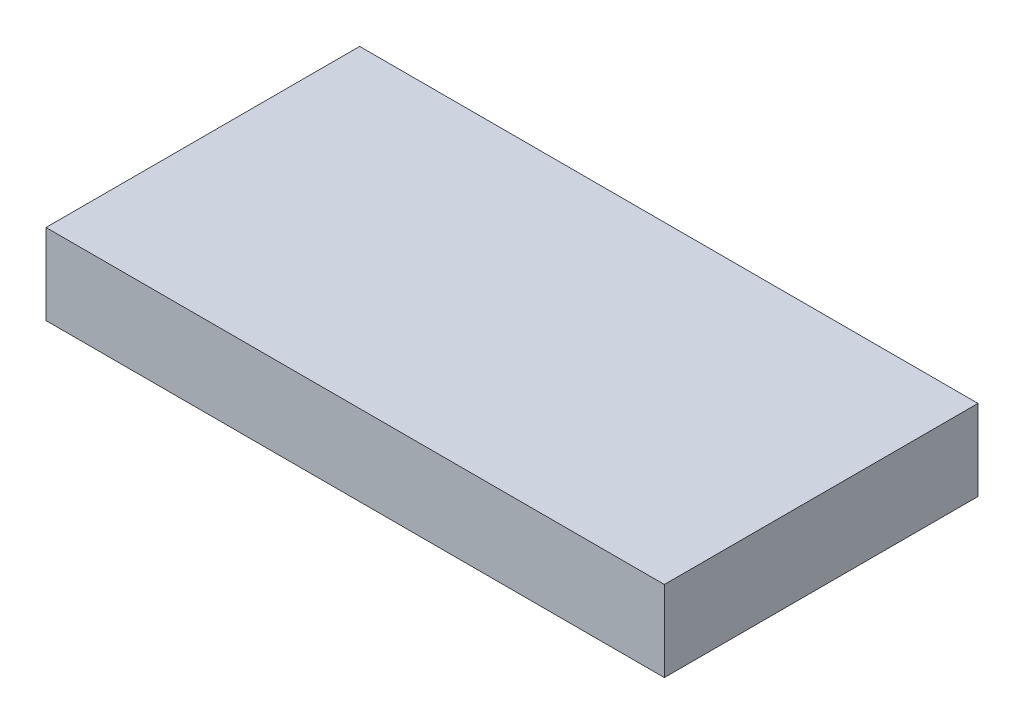
ISO-10303-21;
HEADER;
FILE_DESCRIPTION(('STEP AP214'),'2;1');
FILE_NAME('part.step','',(''),(''),'','','');
FILE_SCHEMA(('AUTOMOTIVE_DESIGN { 1 0 10303 214 1 1 1 1 }'));
ENDSEC;
DATA;
#1=APPLICATION_CONTEXT('core data for automotive mechanical design processes');
#2=APPLICATION_PROTOCOL_DEFINITION('international standard','automotive_design',2000,#1);
#3=PRODUCT_CONTEXT('',#1,'mechanical');
#4=PRODUCT('Part','Part','',(#3));
#5=PRODUCT_RELATED_PRODUCT_CATEGORY('part','',(#4));
#6=PRODUCT_DEFINITION_FORMATION('','',#4);
#7=PRODUCT_DEFINITION_CONTEXT('part definition',#1,'design');
#8=PRODUCT_DEFINITION('design','',#6,#7);
#9=PRODUCT_DEFINITION_SHAPE('','',#8);
#10=(LENGTH_UNIT() NAMED_UNIT(*) SI_UNIT(.MILLI.,.METRE.));
#11=(NAMED_UNIT(*) PLANE_ANGLE_UNIT() SI_UNIT($,.RADIAN.));
#12=(NAMED_UNIT(*) SI_UNIT($,.STERADIAN.) SOLID_ANGLE_UNIT());
#13=UNCERTAINTY_MEASURE_WITH_UNIT(LENGTH_MEASURE(1.E-05),#10,'distance_accuracy_value','');
#14=(GEOMETRIC_REPRESENTATION_CONTEXT(3) GLOBAL_UNCERTAINTY_ASSIGNED_CONTEXT((#13)) GLOBAL_UNIT_ASSIGNED_CONTEXT((#10,
#11,#12)) REPRESENTATION_CONTEXT('',''));
#15=CARTESIAN_POINT('',(0.,0.,0.));
#16=DIRECTION('',(0.,0.,1.));
#17=DIRECTION('',(1.,0.,0.));
#18=AXIS2_PLACEMENT_3D('',#15,#16,#17);
#19=CARTESIAN_POINT('',(-25.693945935068,-9.,26.7679874807297));
#20=DIRECTION('',(-1.,0.,0.));
#21=DIRECTION('',(0.,0.,1.));
#22=AXIS2_PLACEMENT_3D('',#19,#20,#21);
#23=PLANE('',#22);
#24=DIRECTION('',(0.,0.,1.));
#25=VECTOR('',#24,1.);
#26=CARTESIAN_POINT('',(-25.693945935068,0.,26.7679874807297));
#27=LINE('',#26,#25);
#28=CARTESIAN_POINT('',(-25.693945935068,0.,-8.23201251927028));
#29=VERTEX_POINT('',#28);
#30=CARTESIAN_POINT('',(-25.693945935068,0.,26.7679874807297));
#31=VERTEX_POINT('',#30);
#32=EDGE_CURVE('E101',#29,#31,#27,.T.);
#33=ORIENTED_EDGE('',*,*,#32,.F.);
#34=DIRECTION('',(0.,1.,0.));
#35=VECTOR('',#34,1.);
#36=CARTESIAN_POINT('',(-25.693945935068,-9.,-8.23201251927028));
#37=LINE('',#36,#35);
#38=CARTESIAN_POINT('',(-25.693945935068,-9.,-8.23201251927028));
#39=VERTEX_POINT('',#38);
#40=EDGE_CURVE('E11',#39,#29,#37,.T.);
#41=ORIENTED_EDGE('',*,*,#40,.F.);
#42=DIRECTION('',(0.,0.,1.));
#43=VECTOR('',#42,1.);
#44=CARTESIAN_POINT('',(-25.693945935068,-9.,26.7679874807297));
#45=LINE('',#44,#43);
#46=CARTESIAN_POINT('',(-25.693945935068,-9.,26.7679874807297));
#47=VERTEX_POINT('',#46);
#48=EDGE_CURVE('E95',#39,#47,#45,.T.);
#49=ORIENTED_EDGE('',*,*,#48,.T.);
#50=DIRECTION('',(0.,1.,0.));
#51=VECTOR('',#50,1.);
#52=CARTESIAN_POINT('',(-25.693945935068,-9.,26.7679874807297));
#53=LINE('',#52,#51);
#54=EDGE_CURVE('E40',#47,#31,#53,.T.);
#55=ORIENTED_EDGE('',*,*,#54,.T.);
#56=EDGE_LOOP('',(#33,#41,#49,#55));
#57=FACE_BOUND('',#56,.T.);
#58=ADVANCED_FACE('F37',(#57),#23,.T.);
#59=CARTESIAN_POINT('',(-25.693945935068,-9.,-8.23201251927028));
#60=DIRECTION('',(0.,0.,-1.));
#61=DIRECTION('',(-1.,0.,0.));
#62=AXIS2_PLACEMENT_3D('',#59,#60,#61);
#63=PLANE('',#62);
#64=DIRECTION('',(-1.,0.,0.));
#65=VECTOR('',#64,1.);
#66=CARTESIAN_POINT('',(-25.693945935068,0.,-8.23201251927028));
#67=LINE('',#66,#65);
#68=CARTESIAN_POINT('',(43.306054064932,0.,-8.2320125192703));
#69=VERTEX_POINT('',#68);
#70=EDGE_CURVE('E97',#69,#29,#67,.T.);
#71=ORIENTED_EDGE('',*,*,#70,.F.);
#72=DIRECTION('',(0.,1.,0.));
#73=VECTOR('',#72,1.);
#74=CARTESIAN_POINT('',(43.306054064932,-9.,-8.2320125192703));
#75=LINE('',#74,#73);
#76=CARTESIAN_POINT('',(43.306054064932,-9.,-8.2320125192703));
#77=VERTEX_POINT('',#76);
#78=EDGE_CURVE('E46',#77,#69,#75,.T.);
#79=ORIENTED_EDGE('',*,*,#78,.F.);
#80=DIRECTION('',(-1.,0.,0.));
#81=VECTOR('',#80,1.);
#82=CARTESIAN_POINT('',(-25.693945935068,-9.,-8.23201251927028));
#83=LINE('',#82,#81);
#84=EDGE_CURVE('E92',#77,#39,#83,.T.);
#85=ORIENTED_EDGE('',*,*,#84,.T.);
#86=ORIENTED_EDGE('',*,*,#40,.T.);
#87=EDGE_LOOP('',(#71,#79,#85,#86));
#88=FACE_BOUND('',#87,.T.);
#89=ADVANCED_FACE('F111',(#88),#63,.T.);
#90=CARTESIAN_POINT('',(43.306054064932,-9.,26.7679874807297));
#91=DIRECTION('',(1.,0.,0.));
#92=DIRECTION('',(0.,0.,-1.));
#93=AXIS2_PLACEMENT_3D('',#90,#91,#92);
#94=PLANE('',#93);
#95=DIRECTION('',(0.,0.,-1.));
#96=VECTOR('',#95,1.);
#97=CARTESIAN_POINT('',(43.306054064932,0.,26.7679874807297));
#98=LINE('',#97,#96);
#99=CARTESIAN_POINT('',(43.306054064932,0.,26.7679874807297));
#100=VERTEX_POINT('',#99);
#101=EDGE_CURVE('E87',#100,#69,#98,.T.);
#102=ORIENTED_EDGE('',*,*,#101,.F.);
#103=DIRECTION('',(0.,1.,0.));
#104=VECTOR('',#103,1.);
#105=CARTESIAN_POINT('',(43.306054064932,-9.,26.7679874807297));
#106=LINE('',#105,#104);
#107=CARTESIAN_POINT('',(43.306054064932,-9.,26.7679874807297));
#108=VERTEX_POINT('',#107);
#109=EDGE_CURVE('E82',#108,#100,#106,.T.);
#110=ORIENTED_EDGE('',*,*,#109,.F.);
#111=DIRECTION('',(0.,0.,-1.));
#112=VECTOR('',#111,1.);
#113=CARTESIAN_POINT('',(43.306054064932,-9.,26.7679874807297));
#114=LINE('',#113,#112);
#115=EDGE_CURVE('E85',#108,#77,#114,.T.);
#116=ORIENTED_EDGE('',*,*,#115,.T.);
#117=ORIENTED_EDGE('',*,*,#78,.T.);
#118=EDGE_LOOP('',(#102,#110,#116,#117));
#119=FACE_BOUND('',#118,.T.);
#120=ADVANCED_FACE('F84',(#119),#94,.T.);
#121=CARTESIAN_POINT('',(-25.693945935068,-9.,26.7679874807297));
#122=DIRECTION('',(0.,0.,1.));
#123=DIRECTION('',(1.,0.,0.));
#124=AXIS2_PLACEMENT_3D('',#121,#122,#123);
#125=PLANE('',#124);
#126=DIRECTION('',(1.,0.,0.));
#127=VECTOR('',#126,1.);
#128=CARTESIAN_POINT('',(-25.693945935068,0.,26.7679874807297));
#129=LINE('',#128,#127);
#130=EDGE_CURVE('E104',#31,#100,#129,.T.);
#131=ORIENTED_EDGE('',*,*,#130,.F.);
#132=ORIENTED_EDGE('',*,*,#54,.F.);
#133=DIRECTION('',(1.,0.,0.));
#134=VECTOR('',#133,1.);
#135=CARTESIAN_POINT('',(-25.693945935068,-9.,26.7679874807297));
#136=LINE('',#135,#134);
#137=EDGE_CURVE('E91',#47,#108,#136,.T.);
#138=ORIENTED_EDGE('',*,*,#137,.T.);
#139=ORIENTED_EDGE('',*,*,#109,.T.);
#140=EDGE_LOOP('',(#131,#132,#138,#139));
#141=FACE_BOUND('',#140,.T.);
#142=ADVANCED_FACE('F94',(#141),#125,.T.);
#143=CARTESIAN_POINT('',(0.,-9.,0.));
#144=DIRECTION('',(0.,-1.,0.));
#145=DIRECTION('',(0.,0.,-1.));
#146=AXIS2_PLACEMENT_3D('',#143,#144,#145);
#147=PLANE('',#146);
#148=ORIENTED_EDGE('',*,*,#48,.F.);
#149=ORIENTED_EDGE('',*,*,#84,.F.);
#150=ORIENTED_EDGE('',*,*,#115,.F.);
#151=ORIENTED_EDGE('',*,*,#137,.F.);
#152=EDGE_LOOP('',(#148,#149,#150,#151));
#153=FACE_BOUND('',#152,.T.);
#154=ADVANCED_FACE('F90',(#153),#147,.T.);
#155=CARTESIAN_POINT('',(0.,0.,0.));
#156=DIRECTION('',(0.,-1.,0.));
#157=DIRECTION('',(0.,0.,-1.));
#158=AXIS2_PLACEMENT_3D('',#155,#156,#157);
#159=PLANE('',#158);
#160=ORIENTED_EDGE('',*,*,#32,.T.);
#161=ORIENTED_EDGE('',*,*,#130,.T.);
#162=ORIENTED_EDGE('',*,*,#101,.T.);
#163=ORIENTED_EDGE('',*,*,#70,.T.);
#164=EDGE_LOOP('',(#160,#161,#162,#163));
#165=FACE_BOUND('',#164,.T.);
#166=ADVANCED_FACE('F110',(#165),#159,.F.);
#167=CLOSED_SHELL('',(#58,#89,#120,#142,#154,#166));
#168=MANIFOLD_SOLID_BREP('B2',#167);
#169=ADVANCED_BREP_SHAPE_REPRESENTATION('',(#18,#168),#14);
#170=SHAPE_DEFINITION_REPRESENTATION(#9,#169);
ENDSEC;
END-ISO-10303-21;
